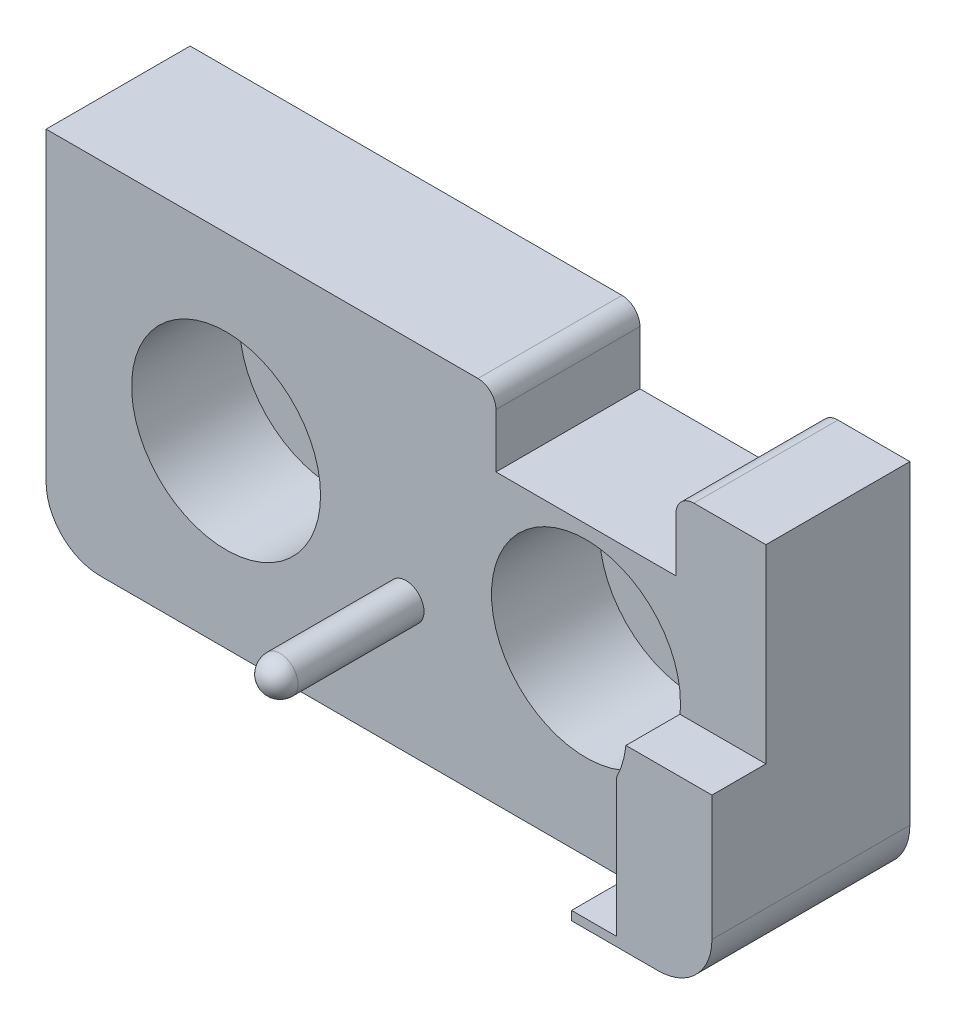
ISO-10303-21;
HEADER;
FILE_DESCRIPTION(('STEP AP214'),'2;1');
FILE_NAME('part.step','',(''),(''),'','','');
FILE_SCHEMA(('AUTOMOTIVE_DESIGN { 1 0 10303 214 1 1 1 1 }'));
ENDSEC;
DATA;
#1=APPLICATION_CONTEXT('core data for automotive mechanical design processes');
#2=APPLICATION_PROTOCOL_DEFINITION('international standard','automotive_design',2000,#1);
#3=PRODUCT_CONTEXT('',#1,'mechanical');
#4=PRODUCT('Part','Part','',(#3));
#5=PRODUCT_RELATED_PRODUCT_CATEGORY('part','',(#4));
#6=PRODUCT_DEFINITION_FORMATION('','',#4);
#7=PRODUCT_DEFINITION_CONTEXT('part definition',#1,'design');
#8=PRODUCT_DEFINITION('design','',#6,#7);
#9=PRODUCT_DEFINITION_SHAPE('','',#8);
#10=(LENGTH_UNIT() NAMED_UNIT(*) SI_UNIT(.MILLI.,.METRE.));
#11=(NAMED_UNIT(*) PLANE_ANGLE_UNIT() SI_UNIT($,.RADIAN.));
#12=(NAMED_UNIT(*) SI_UNIT($,.STERADIAN.) SOLID_ANGLE_UNIT());
#13=UNCERTAINTY_MEASURE_WITH_UNIT(LENGTH_MEASURE(1.E-05),#10,'distance_accuracy_value','');
#14=(GEOMETRIC_REPRESENTATION_CONTEXT(3) GLOBAL_UNCERTAINTY_ASSIGNED_CONTEXT((#13)) GLOBAL_UNIT_ASSIGNED_CONTEXT((#10,
#11,#12)) REPRESENTATION_CONTEXT('',''));
#15=CARTESIAN_POINT('',(0.,0.,0.));
#16=DIRECTION('',(0.,0.,1.));
#17=DIRECTION('',(1.,0.,0.));
#18=AXIS2_PLACEMENT_3D('',#15,#16,#17);
#19=CARTESIAN_POINT('',(17.,-7.,8.));
#20=DIRECTION('',(0.,0.,1.));
#21=DIRECTION('',(1.,0.,0.));
#22=AXIS2_PLACEMENT_3D('',#19,#20,#21);
#23=PLANE('',#22);
#24=DIRECTION('',(0.,-1.,0.));
#25=VECTOR('',#24,1.);
#26=CARTESIAN_POINT('',(14.7,-7.,8.));
#27=LINE('',#26,#25);
#28=CARTESIAN_POINT('',(14.7,-2.33933751305791,8.));
#29=VERTEX_POINT('',#28);
#30=CARTESIAN_POINT('',(14.7,-10.,8.));
#31=VERTEX_POINT('',#30);
#32=EDGE_CURVE('E227',#29,#31,#27,.T.);
#33=ORIENTED_EDGE('',*,*,#32,.F.);
#34=CARTESIAN_POINT('',(10.,0.,8.));
#35=DIRECTION('',(0.,0.,1.));
#36=DIRECTION('',(1.,0.,0.));
#37=AXIS2_PLACEMENT_3D('',#34,#35,#36);
#38=CIRCLE('',#37,5.25);
#39=CARTESIAN_POINT('',(15.2211109928826,-0.550000000000002,8.));
#40=VERTEX_POINT('',#39);
#41=EDGE_CURVE('E245',#40,#29,#38,.T.);
#42=ORIENTED_EDGE('',*,*,#41,.F.);
#43=DIRECTION('',(-1.,0.,0.));
#44=VECTOR('',#43,1.);
#45=CARTESIAN_POINT('',(17.,-0.550000000000002,8.));
#46=LINE('',#45,#44);
#47=CARTESIAN_POINT('',(20.,-0.550000000000001,8.));
#48=VERTEX_POINT('',#47);
#49=EDGE_CURVE('E213',#48,#40,#46,.T.);
#50=ORIENTED_EDGE('',*,*,#49,.F.);
#51=DIRECTION('',(0.,1.,0.));
#52=VECTOR('',#51,1.);
#53=CARTESIAN_POINT('',(20.,-6.99999999999998,8.));
#54=LINE('',#53,#52);
#55=CARTESIAN_POINT('',(20.,10.,8.));
#56=VERTEX_POINT('',#55);
#57=EDGE_CURVE('E171',#48,#56,#54,.T.);
#58=ORIENTED_EDGE('',*,*,#57,.T.);
#59=DIRECTION('',(-1.,0.,0.));
#60=VECTOR('',#59,1.);
#61=CARTESIAN_POINT('',(16.,10.,8.));
#62=LINE('',#61,#60);
#63=CARTESIAN_POINT('',(16.,10.,8.));
#64=VERTEX_POINT('',#63);
#65=EDGE_CURVE('E258',#56,#64,#62,.T.);
#66=ORIENTED_EDGE('',*,*,#65,.T.);
#67=CARTESIAN_POINT('',(16.,9.,8.));
#68=DIRECTION('',(0.,0.,1.));
#69=DIRECTION('',(1.,0.,0.));
#70=AXIS2_PLACEMENT_3D('',#67,#68,#69);
#71=CIRCLE('',#70,1.);
#72=CARTESIAN_POINT('',(15.,8.99999999999999,8.));
#73=VERTEX_POINT('',#72);
#74=EDGE_CURVE('E261',#64,#73,#71,.T.);
#75=ORIENTED_EDGE('',*,*,#74,.T.);
#76=DIRECTION('',(0.,-1.,0.));
#77=VECTOR('',#76,1.);
#78=CARTESIAN_POINT('',(15.,8.99999999999999,8.));
#79=LINE('',#78,#77);
#80=CARTESIAN_POINT('',(15.,6.,8.));
#81=VERTEX_POINT('',#80);
#82=EDGE_CURVE('E264',#73,#81,#79,.T.);
#83=ORIENTED_EDGE('',*,*,#82,.T.);
#84=DIRECTION('',(-1.,0.,0.));
#85=VECTOR('',#84,1.);
#86=CARTESIAN_POINT('',(5.,6.,8.));
#87=LINE('',#86,#85);
#88=CARTESIAN_POINT('',(5.,6.,8.));
#89=VERTEX_POINT('',#88);
#90=EDGE_CURVE('E266',#81,#89,#87,.T.);
#91=ORIENTED_EDGE('',*,*,#90,.T.);
#92=DIRECTION('',(0.,1.,0.));
#93=VECTOR('',#92,1.);
#94=CARTESIAN_POINT('',(5.,8.99999999999999,8.));
#95=LINE('',#94,#93);
#96=CARTESIAN_POINT('',(5.,8.99999999999999,8.));
#97=VERTEX_POINT('',#96);
#98=EDGE_CURVE('E268',#89,#97,#95,.T.);
#99=ORIENTED_EDGE('',*,*,#98,.T.);
#100=CARTESIAN_POINT('',(4.,9.,8.));
#101=DIRECTION('',(0.,0.,1.));
#102=DIRECTION('',(-1.,0.,0.));
#103=AXIS2_PLACEMENT_3D('',#100,#101,#102);
#104=CIRCLE('',#103,1.);
#105=CARTESIAN_POINT('',(3.99999999999999,10.,8.));
#106=VERTEX_POINT('',#105);
#107=EDGE_CURVE('E270',#97,#106,#104,.T.);
#108=ORIENTED_EDGE('',*,*,#107,.T.);
#109=DIRECTION('',(-1.,0.,0.));
#110=VECTOR('',#109,1.);
#111=CARTESIAN_POINT('',(-20.,10.,8.));
#112=LINE('',#111,#110);
#113=CARTESIAN_POINT('',(-20.,10.,8.));
#114=VERTEX_POINT('',#113);
#115=EDGE_CURVE('E272',#106,#114,#112,.T.);
#116=ORIENTED_EDGE('',*,*,#115,.T.);
#117=DIRECTION('',(0.,-1.,0.));
#118=VECTOR('',#117,1.);
#119=CARTESIAN_POINT('',(-20.,-6.99999999999998,8.));
#120=LINE('',#119,#118);
#121=CARTESIAN_POINT('',(-20.,-6.99999999999998,8.));
#122=VERTEX_POINT('',#121);
#123=EDGE_CURVE('E274',#114,#122,#120,.T.);
#124=ORIENTED_EDGE('',*,*,#123,.T.);
#125=CARTESIAN_POINT('',(-17.,-7.,8.));
#126=DIRECTION('',(0.,0.,1.));
#127=DIRECTION('',(-1.,0.,0.));
#128=AXIS2_PLACEMENT_3D('',#125,#126,#127);
#129=CIRCLE('',#128,3.);
#130=CARTESIAN_POINT('',(-17.,-10.,8.));
#131=VERTEX_POINT('',#130);
#132=EDGE_CURVE('E276',#122,#131,#129,.T.);
#133=ORIENTED_EDGE('',*,*,#132,.T.);
#134=DIRECTION('',(1.,0.,0.));
#135=VECTOR('',#134,1.);
#136=CARTESIAN_POINT('',(-17.,-10.,8.));
#137=LINE('',#136,#135);
#138=CARTESIAN_POINT('',(12.2,-10.,8.));
#139=VERTEX_POINT('',#138);
#140=EDGE_CURVE('E278',#131,#139,#137,.T.);
#141=ORIENTED_EDGE('',*,*,#140,.T.);
#142=DIRECTION('',(-1.,0.,0.));
#143=VECTOR('',#142,1.);
#144=CARTESIAN_POINT('',(17.,-10.,8.));
#145=LINE('',#144,#143);
#146=EDGE_CURVE('E49',#31,#139,#145,.T.);
#147=ORIENTED_EDGE('',*,*,#146,.F.);
#148=EDGE_LOOP('',(#33,#42,#50,#58,#66,#75,#83,#91,#99,#108,#116,#124,#133,#141,#147));
#149=FACE_BOUND('',#148,.T.);
#150=CARTESIAN_POINT('',(-10.,0.,8.));
#151=DIRECTION('',(0.,0.,1.));
#152=DIRECTION('',(1.,0.,0.));
#153=AXIS2_PLACEMENT_3D('',#150,#151,#152);
#154=CIRCLE('',#153,5.25);
#155=CARTESIAN_POINT('',(-4.75,0.,8.));
#156=VERTEX_POINT('',#155);
#157=EDGE_CURVE('E233',#156,#156,#154,.T.);
#158=ORIENTED_EDGE('',*,*,#157,.F.);
#159=EDGE_LOOP('',(#158));
#160=FACE_BOUND('',#159,.T.);
#161=CARTESIAN_POINT('',(0.,-2.72729824717982,8.));
#162=DIRECTION('',(0.,0.,1.));
#163=DIRECTION('',(1.,0.,0.));
#164=AXIS2_PLACEMENT_3D('',#161,#162,#163);
#165=CIRCLE('',#164,1.);
#166=CARTESIAN_POINT('',(1.,-2.72729824717982,8.));
#167=VERTEX_POINT('',#166);
#168=EDGE_CURVE('E230',#167,#167,#165,.T.);
#169=ORIENTED_EDGE('',*,*,#168,.F.);
#170=EDGE_LOOP('',(#169));
#171=FACE_BOUND('',#170,.T.);
#172=ADVANCED_FACE('F34',(#149,#160,#171),#23,.T.);
#173=CARTESIAN_POINT('',(16.,10.,8.));
#174=DIRECTION('',(0.,-1.,0.));
#175=DIRECTION('',(1.,0.,0.));
#176=AXIS2_PLACEMENT_3D('',#173,#174,#175);
#177=PLANE('',#176);
#178=DIRECTION('',(-1.,0.,0.));
#179=VECTOR('',#178,1.);
#180=CARTESIAN_POINT('',(16.,10.,0.));
#181=LINE('',#180,#179);
#182=CARTESIAN_POINT('',(20.,10.,0.));
#183=VERTEX_POINT('',#182);
#184=CARTESIAN_POINT('',(16.,10.,0.));
#185=VERTEX_POINT('',#184);
#186=EDGE_CURVE('E257',#183,#185,#181,.T.);
#187=ORIENTED_EDGE('',*,*,#186,.T.);
#188=DIRECTION('',(0.,0.,-1.));
#189=VECTOR('',#188,1.);
#190=CARTESIAN_POINT('',(16.,10.,8.));
#191=LINE('',#190,#189);
#192=EDGE_CURVE('E42',#64,#185,#191,.T.);
#193=ORIENTED_EDGE('',*,*,#192,.F.);
#194=ORIENTED_EDGE('',*,*,#65,.F.);
#195=DIRECTION('',(0.,0.,-1.));
#196=VECTOR('',#195,1.);
#197=CARTESIAN_POINT('',(20.,10.,8.));
#198=LINE('',#197,#196);
#199=EDGE_CURVE('E281',#56,#183,#198,.T.);
#200=ORIENTED_EDGE('',*,*,#199,.T.);
#201=EDGE_LOOP('',(#187,#193,#194,#200));
#202=FACE_BOUND('',#201,.T.);
#203=ADVANCED_FACE('F336',(#202),#177,.F.);
#204=CARTESIAN_POINT('',(16.,9.,8.));
#205=DIRECTION('',(0.,0.,-1.));
#206=DIRECTION('',(-1.,0.,0.));
#207=AXIS2_PLACEMENT_3D('',#204,#205,#206);
#208=CYLINDRICAL_SURFACE('',#207,1.);
#209=CARTESIAN_POINT('',(16.,9.,0.));
#210=DIRECTION('',(0.,0.,1.));
#211=DIRECTION('',(1.,0.,0.));
#212=AXIS2_PLACEMENT_3D('',#209,#210,#211);
#213=CIRCLE('',#212,1.);
#214=CARTESIAN_POINT('',(15.,8.99999999999999,0.));
#215=VERTEX_POINT('',#214);
#216=EDGE_CURVE('E284',#185,#215,#213,.T.);
#217=ORIENTED_EDGE('',*,*,#216,.T.);
#218=DIRECTION('',(0.,0.,-1.));
#219=VECTOR('',#218,1.);
#220=CARTESIAN_POINT('',(15.,8.99999999999999,8.));
#221=LINE('',#220,#219);
#222=EDGE_CURVE('E326',#73,#215,#221,.T.);
#223=ORIENTED_EDGE('',*,*,#222,.F.);
#224=ORIENTED_EDGE('',*,*,#74,.F.);
#225=ORIENTED_EDGE('',*,*,#192,.T.);
#226=EDGE_LOOP('',(#217,#223,#224,#225));
#227=FACE_BOUND('',#226,.T.);
#228=ADVANCED_FACE('F331',(#227),#208,.T.);
#229=CARTESIAN_POINT('',(15.,8.99999999999999,8.));
#230=DIRECTION('',(1.,0.,0.));
#231=DIRECTION('',(0.,1.,0.));
#232=AXIS2_PLACEMENT_3D('',#229,#230,#231);
#233=PLANE('',#232);
#234=DIRECTION('',(0.,-1.,0.));
#235=VECTOR('',#234,1.);
#236=CARTESIAN_POINT('',(15.,8.99999999999999,0.));
#237=LINE('',#236,#235);
#238=CARTESIAN_POINT('',(15.,6.,0.));
#239=VERTEX_POINT('',#238);
#240=EDGE_CURVE('E286',#215,#239,#237,.T.);
#241=ORIENTED_EDGE('',*,*,#240,.T.);
#242=DIRECTION('',(0.,0.,-1.));
#243=VECTOR('',#242,1.);
#244=CARTESIAN_POINT('',(15.,6.,8.));
#245=LINE('',#244,#243);
#246=EDGE_CURVE('E323',#81,#239,#245,.T.);
#247=ORIENTED_EDGE('',*,*,#246,.F.);
#248=ORIENTED_EDGE('',*,*,#82,.F.);
#249=ORIENTED_EDGE('',*,*,#222,.T.);
#250=EDGE_LOOP('',(#241,#247,#248,#249));
#251=FACE_BOUND('',#250,.T.);
#252=ADVANCED_FACE('F346',(#251),#233,.F.);
#253=CARTESIAN_POINT('',(5.,6.,8.));
#254=DIRECTION('',(0.,-1.,0.));
#255=DIRECTION('',(1.,0.,0.));
#256=AXIS2_PLACEMENT_3D('',#253,#254,#255);
#257=PLANE('',#256);
#258=DIRECTION('',(-1.,0.,0.));
#259=VECTOR('',#258,1.);
#260=CARTESIAN_POINT('',(5.,6.,0.));
#261=LINE('',#260,#259);
#262=CARTESIAN_POINT('',(5.,6.,0.));
#263=VERTEX_POINT('',#262);
#264=EDGE_CURVE('E288',#239,#263,#261,.T.);
#265=ORIENTED_EDGE('',*,*,#264,.T.);
#266=DIRECTION('',(0.,0.,-1.));
#267=VECTOR('',#266,1.);
#268=CARTESIAN_POINT('',(5.,6.,8.));
#269=LINE('',#268,#267);
#270=EDGE_CURVE('E320',#89,#263,#269,.T.);
#271=ORIENTED_EDGE('',*,*,#270,.F.);
#272=ORIENTED_EDGE('',*,*,#90,.F.);
#273=ORIENTED_EDGE('',*,*,#246,.T.);
#274=EDGE_LOOP('',(#265,#271,#272,#273));
#275=FACE_BOUND('',#274,.T.);
#276=ADVANCED_FACE('F350',(#275),#257,.F.);
#277=CARTESIAN_POINT('',(5.,8.99999999999999,8.));
#278=DIRECTION('',(-1.,0.,0.));
#279=DIRECTION('',(0.,-1.,0.));
#280=AXIS2_PLACEMENT_3D('',#277,#278,#279);
#281=PLANE('',#280);
#282=DIRECTION('',(0.,1.,0.));
#283=VECTOR('',#282,1.);
#284=CARTESIAN_POINT('',(5.,8.99999999999999,0.));
#285=LINE('',#284,#283);
#286=CARTESIAN_POINT('',(5.,8.99999999999999,0.));
#287=VERTEX_POINT('',#286);
#288=EDGE_CURVE('E290',#263,#287,#285,.T.);
#289=ORIENTED_EDGE('',*,*,#288,.T.);
#290=DIRECTION('',(0.,0.,-1.));
#291=VECTOR('',#290,1.);
#292=CARTESIAN_POINT('',(5.,8.99999999999999,8.));
#293=LINE('',#292,#291);
#294=EDGE_CURVE('E317',#97,#287,#293,.T.);
#295=ORIENTED_EDGE('',*,*,#294,.F.);
#296=ORIENTED_EDGE('',*,*,#98,.F.);
#297=ORIENTED_EDGE('',*,*,#270,.T.);
#298=EDGE_LOOP('',(#289,#295,#296,#297));
#299=FACE_BOUND('',#298,.T.);
#300=ADVANCED_FACE('F423',(#299),#281,.F.);
#301=CARTESIAN_POINT('',(4.,9.,8.));
#302=DIRECTION('',(0.,0.,-1.));
#303=DIRECTION('',(-1.,0.,0.));
#304=AXIS2_PLACEMENT_3D('',#301,#302,#303);
#305=CYLINDRICAL_SURFACE('',#304,1.);
#306=CARTESIAN_POINT('',(4.,9.,0.));
#307=DIRECTION('',(0.,0.,1.));
#308=DIRECTION('',(-1.,0.,0.));
#309=AXIS2_PLACEMENT_3D('',#306,#307,#308);
#310=CIRCLE('',#309,1.);
#311=CARTESIAN_POINT('',(3.99999999999999,10.,0.));
#312=VERTEX_POINT('',#311);
#313=EDGE_CURVE('E292',#287,#312,#310,.T.);
#314=ORIENTED_EDGE('',*,*,#313,.T.);
#315=DIRECTION('',(0.,0.,-1.));
#316=VECTOR('',#315,1.);
#317=CARTESIAN_POINT('',(3.99999999999999,10.,8.));
#318=LINE('',#317,#316);
#319=EDGE_CURVE('E314',#106,#312,#318,.T.);
#320=ORIENTED_EDGE('',*,*,#319,.F.);
#321=ORIENTED_EDGE('',*,*,#107,.F.);
#322=ORIENTED_EDGE('',*,*,#294,.T.);
#323=EDGE_LOOP('',(#314,#320,#321,#322));
#324=FACE_BOUND('',#323,.T.);
#325=ADVANCED_FACE('F419',(#324),#305,.T.);
#326=CARTESIAN_POINT('',(-20.,10.,8.));
#327=DIRECTION('',(0.,-1.,0.));
#328=DIRECTION('',(0.,0.,-1.));
#329=AXIS2_PLACEMENT_3D('',#326,#327,#328);
#330=PLANE('',#329);
#331=DIRECTION('',(-1.,0.,0.));
#332=VECTOR('',#331,1.);
#333=CARTESIAN_POINT('',(-20.,10.,0.));
#334=LINE('',#333,#332);
#335=CARTESIAN_POINT('',(-20.,10.,0.));
#336=VERTEX_POINT('',#335);
#337=EDGE_CURVE('E294',#312,#336,#334,.T.);
#338=ORIENTED_EDGE('',*,*,#337,.T.);
#339=DIRECTION('',(0.,0.,-1.));
#340=VECTOR('',#339,1.);
#341=CARTESIAN_POINT('',(-20.,10.,8.));
#342=LINE('',#341,#340);
#343=EDGE_CURVE('E311',#114,#336,#342,.T.);
#344=ORIENTED_EDGE('',*,*,#343,.F.);
#345=ORIENTED_EDGE('',*,*,#115,.F.);
#346=ORIENTED_EDGE('',*,*,#319,.T.);
#347=EDGE_LOOP('',(#338,#344,#345,#346));
#348=FACE_BOUND('',#347,.T.);
#349=ADVANCED_FACE('F415',(#348),#330,.F.);
#350=CARTESIAN_POINT('',(-20.,-6.99999999999998,8.));
#351=DIRECTION('',(1.,0.,0.));
#352=DIRECTION('',(0.,0.,-1.));
#353=AXIS2_PLACEMENT_3D('',#350,#351,#352);
#354=PLANE('',#353);
#355=DIRECTION('',(0.,-1.,0.));
#356=VECTOR('',#355,1.);
#357=CARTESIAN_POINT('',(-20.,-6.99999999999998,0.));
#358=LINE('',#357,#356);
#359=CARTESIAN_POINT('',(-20.,-6.99999999999998,0.));
#360=VERTEX_POINT('',#359);
#361=EDGE_CURVE('E296',#336,#360,#358,.T.);
#362=ORIENTED_EDGE('',*,*,#361,.T.);
#363=DIRECTION('',(0.,0.,-1.));
#364=VECTOR('',#363,1.);
#365=CARTESIAN_POINT('',(-20.,-6.99999999999998,8.));
#366=LINE('',#365,#364);
#367=EDGE_CURVE('E308',#122,#360,#366,.T.);
#368=ORIENTED_EDGE('',*,*,#367,.F.);
#369=ORIENTED_EDGE('',*,*,#123,.F.);
#370=ORIENTED_EDGE('',*,*,#343,.T.);
#371=EDGE_LOOP('',(#362,#368,#369,#370));
#372=FACE_BOUND('',#371,.T.);
#373=ADVANCED_FACE('F411',(#372),#354,.F.);
#374=CARTESIAN_POINT('',(-17.,-7.,8.));
#375=DIRECTION('',(0.,0.,-1.));
#376=DIRECTION('',(-1.,0.,0.));
#377=AXIS2_PLACEMENT_3D('',#374,#375,#376);
#378=CYLINDRICAL_SURFACE('',#377,3.);
#379=CARTESIAN_POINT('',(-17.,-7.,0.));
#380=DIRECTION('',(0.,0.,1.));
#381=DIRECTION('',(-1.,0.,0.));
#382=AXIS2_PLACEMENT_3D('',#379,#380,#381);
#383=CIRCLE('',#382,3.);
#384=CARTESIAN_POINT('',(-17.,-10.,0.));
#385=VERTEX_POINT('',#384);
#386=EDGE_CURVE('E298',#360,#385,#383,.T.);
#387=ORIENTED_EDGE('',*,*,#386,.T.);
#388=DIRECTION('',(0.,0.,-1.));
#389=VECTOR('',#388,1.);
#390=CARTESIAN_POINT('',(-17.,-10.,8.));
#391=LINE('',#390,#389);
#392=EDGE_CURVE('E305',#131,#385,#391,.T.);
#393=ORIENTED_EDGE('',*,*,#392,.F.);
#394=ORIENTED_EDGE('',*,*,#132,.F.);
#395=ORIENTED_EDGE('',*,*,#367,.T.);
#396=EDGE_LOOP('',(#387,#393,#394,#395));
#397=FACE_BOUND('',#396,.T.);
#398=ADVANCED_FACE('F408',(#397),#378,.T.);
#399=CARTESIAN_POINT('',(-17.,-10.,8.));
#400=DIRECTION('',(0.,1.,0.));
#401=DIRECTION('',(0.,0.,1.));
#402=AXIS2_PLACEMENT_3D('',#399,#400,#401);
#403=PLANE('',#402);
#404=DIRECTION('',(1.,0.,0.));
#405=VECTOR('',#404,1.);
#406=CARTESIAN_POINT('',(-17.,-10.,0.));
#407=LINE('',#406,#405);
#408=CARTESIAN_POINT('',(12.2,-10.,0.));
#409=VERTEX_POINT('',#408);
#410=EDGE_CURVE('E300',#385,#409,#407,.T.);
#411=ORIENTED_EDGE('',*,*,#410,.T.);
#412=DIRECTION('',(0.,0.,1.));
#413=VECTOR('',#412,1.);
#414=CARTESIAN_POINT('',(12.2,-10.,-12.6428833736612));
#415=LINE('',#414,#413);
#416=EDGE_CURVE('E57',#409,#139,#415,.T.);
#417=ORIENTED_EDGE('',*,*,#416,.T.);
#418=ORIENTED_EDGE('',*,*,#140,.F.);
#419=ORIENTED_EDGE('',*,*,#392,.T.);
#420=EDGE_LOOP('',(#411,#417,#418,#419));
#421=FACE_BOUND('',#420,.T.);
#422=ADVANCED_FACE('F405',(#421),#403,.F.);
#423=CARTESIAN_POINT('',(20.,-6.99999999999998,8.));
#424=DIRECTION('',(-1.,0.,0.));
#425=DIRECTION('',(0.,0.,1.));
#426=AXIS2_PLACEMENT_3D('',#423,#424,#425);
#427=PLANE('',#426);
#428=ORIENTED_EDGE('',*,*,#57,.F.);
#429=DIRECTION('',(0.,0.,1.));
#430=VECTOR('',#429,1.);
#431=CARTESIAN_POINT('',(20.,-0.550000000000001,-12.6428833736612));
#432=LINE('',#431,#430);
#433=CARTESIAN_POINT('',(20.,-0.550000000000001,11.));
#434=VERTEX_POINT('',#433);
#435=EDGE_CURVE('E164',#48,#434,#432,.T.);
#436=ORIENTED_EDGE('',*,*,#435,.T.);
#437=DIRECTION('',(0.,1.,0.));
#438=VECTOR('',#437,1.);
#439=CARTESIAN_POINT('',(20.,-0.550000000000001,11.));
#440=LINE('',#439,#438);
#441=CARTESIAN_POINT('',(20.,-7.49999999999998,11.));
#442=VERTEX_POINT('',#441);
#443=EDGE_CURVE('E169',#442,#434,#440,.T.);
#444=ORIENTED_EDGE('',*,*,#443,.F.);
#445=DIRECTION('',(0.,0.,1.));
#446=VECTOR('',#445,1.);
#447=CARTESIAN_POINT('',(20.,-7.49999999999998,-12.6428833736612));
#448=LINE('',#447,#446);
#449=CARTESIAN_POINT('',(20.,-7.5,0.));
#450=VERTEX_POINT('',#449);
#451=EDGE_CURVE('E209',#450,#442,#448,.T.);
#452=ORIENTED_EDGE('',*,*,#451,.F.);
#453=DIRECTION('',(0.,1.,0.));
#454=VECTOR('',#453,1.);
#455=CARTESIAN_POINT('',(20.,-6.99999999999998,0.));
#456=LINE('',#455,#454);
#457=EDGE_CURVE('E262',#450,#183,#456,.T.);
#458=ORIENTED_EDGE('',*,*,#457,.T.);
#459=ORIENTED_EDGE('',*,*,#199,.F.);
#460=EDGE_LOOP('',(#428,#436,#444,#452,#458,#459));
#461=FACE_BOUND('',#460,.T.);
#462=ADVANCED_FACE('F166',(#461),#427,.F.);
#463=CARTESIAN_POINT('',(17.,-7.,0.));
#464=DIRECTION('',(0.,0.,1.));
#465=DIRECTION('',(1.,0.,0.));
#466=AXIS2_PLACEMENT_3D('',#463,#464,#465);
#467=PLANE('',#466);
#468=ORIENTED_EDGE('',*,*,#457,.F.);
#469=CARTESIAN_POINT('',(17.,-7.5,0.));
#470=DIRECTION('',(0.,0.,1.));
#471=DIRECTION('',(1.,0.,0.));
#472=AXIS2_PLACEMENT_3D('',#469,#470,#471);
#473=CIRCLE('',#472,3.);
#474=CARTESIAN_POINT('',(17.,-10.5,0.));
#475=VERTEX_POINT('',#474);
#476=EDGE_CURVE('E211',#450,#475,#473,.F.);
#477=ORIENTED_EDGE('',*,*,#476,.T.);
#478=DIRECTION('',(-1.,0.,0.));
#479=VECTOR('',#478,1.);
#480=CARTESIAN_POINT('',(12.2,-10.5,0.));
#481=LINE('',#480,#479);
#482=CARTESIAN_POINT('',(12.2,-10.5,0.));
#483=VERTEX_POINT('',#482);
#484=EDGE_CURVE('E208',#475,#483,#481,.T.);
#485=ORIENTED_EDGE('',*,*,#484,.T.);
#486=DIRECTION('',(0.,1.,0.));
#487=VECTOR('',#486,1.);
#488=CARTESIAN_POINT('',(12.2,-10.,0.));
#489=LINE('',#488,#487);
#490=EDGE_CURVE('E205',#483,#409,#489,.T.);
#491=ORIENTED_EDGE('',*,*,#490,.T.);
#492=ORIENTED_EDGE('',*,*,#410,.F.);
#493=ORIENTED_EDGE('',*,*,#386,.F.);
#494=ORIENTED_EDGE('',*,*,#361,.F.);
#495=ORIENTED_EDGE('',*,*,#337,.F.);
#496=ORIENTED_EDGE('',*,*,#313,.F.);
#497=ORIENTED_EDGE('',*,*,#288,.F.);
#498=ORIENTED_EDGE('',*,*,#264,.F.);
#499=ORIENTED_EDGE('',*,*,#240,.F.);
#500=ORIENTED_EDGE('',*,*,#216,.F.);
#501=ORIENTED_EDGE('',*,*,#186,.F.);
#502=EDGE_LOOP('',(#468,#477,#485,#491,#492,#493,#494,#495,#496,#497,#498,#499,#500,#501));
#503=FACE_BOUND('',#502,.T.);
#504=CARTESIAN_POINT('',(-10.,0.,0.));
#505=DIRECTION('',(0.,0.,1.));
#506=DIRECTION('',(1.,0.,0.));
#507=AXIS2_PLACEMENT_3D('',#504,#505,#506);
#508=CIRCLE('',#507,2.75);
#509=CARTESIAN_POINT('',(-7.25,0.,0.));
#510=VERTEX_POINT('',#509);
#511=EDGE_CURVE('E242',#510,#510,#508,.T.);
#512=ORIENTED_EDGE('',*,*,#511,.T.);
#513=EDGE_LOOP('',(#512));
#514=FACE_BOUND('',#513,.T.);
#515=CARTESIAN_POINT('',(10.,0.,0.));
#516=DIRECTION('',(0.,0.,1.));
#517=DIRECTION('',(1.,0.,0.));
#518=AXIS2_PLACEMENT_3D('',#515,#516,#517);
#519=CIRCLE('',#518,2.75);
#520=CARTESIAN_POINT('',(12.75,0.,0.));
#521=VERTEX_POINT('',#520);
#522=EDGE_CURVE('E254',#521,#521,#519,.T.);
#523=ORIENTED_EDGE('',*,*,#522,.T.);
#524=EDGE_LOOP('',(#523));
#525=FACE_BOUND('',#524,.T.);
#526=ADVANCED_FACE('F338',(#503,#514,#525),#467,.F.);
#527=CARTESIAN_POINT('',(10.,0.,8.));
#528=DIRECTION('',(0.,0.,1.));
#529=DIRECTION('',(1.,0.,0.));
#530=AXIS2_PLACEMENT_3D('',#527,#528,#529);
#531=CYLINDRICAL_SURFACE('',#530,2.75);
#532=ORIENTED_EDGE('',*,*,#522,.F.);
#533=EDGE_LOOP('',(#532));
#534=FACE_BOUND('',#533,.T.);
#535=CARTESIAN_POINT('',(10.,0.,2.));
#536=DIRECTION('',(0.,0.,1.));
#537=DIRECTION('',(1.,0.,0.));
#538=AXIS2_PLACEMENT_3D('',#535,#536,#537);
#539=CIRCLE('',#538,2.75);
#540=CARTESIAN_POINT('',(12.75,0.,2.));
#541=VERTEX_POINT('',#540);
#542=EDGE_CURVE('E251',#541,#541,#539,.T.);
#543=ORIENTED_EDGE('',*,*,#542,.T.);
#544=EDGE_LOOP('',(#543));
#545=FACE_BOUND('',#544,.T.);
#546=ADVANCED_FACE('F390',(#534,#545),#531,.F.);
#547=CARTESIAN_POINT('',(12.75,0.,2.));
#548=DIRECTION('',(0.,0.,-1.));
#549=DIRECTION('',(-1.,0.,0.));
#550=AXIS2_PLACEMENT_3D('',#547,#548,#549);
#551=PLANE('',#550);
#552=ORIENTED_EDGE('',*,*,#542,.F.);
#553=EDGE_LOOP('',(#552));
#554=FACE_BOUND('',#553,.T.);
#555=CARTESIAN_POINT('',(10.,0.,2.));
#556=DIRECTION('',(0.,0.,1.));
#557=DIRECTION('',(1.,0.,0.));
#558=AXIS2_PLACEMENT_3D('',#555,#556,#557);
#559=CIRCLE('',#558,5.25);
#560=CARTESIAN_POINT('',(15.25,0.,2.));
#561=VERTEX_POINT('',#560);
#562=EDGE_CURVE('E248',#561,#561,#559,.T.);
#563=ORIENTED_EDGE('',*,*,#562,.T.);
#564=EDGE_LOOP('',(#563));
#565=FACE_BOUND('',#564,.T.);
#566=ADVANCED_FACE('F380',(#554,#565),#551,.F.);
#567=CARTESIAN_POINT('',(10.,0.,8.));
#568=DIRECTION('',(0.,0.,1.));
#569=DIRECTION('',(1.,0.,0.));
#570=AXIS2_PLACEMENT_3D('',#567,#568,#569);
#571=CYLINDRICAL_SURFACE('',#570,5.25);
#572=ORIENTED_EDGE('',*,*,#562,.F.);
#573=EDGE_LOOP('',(#572));
#574=FACE_BOUND('',#573,.T.);
#575=ORIENTED_EDGE('',*,*,#41,.T.);
#576=DIRECTION('',(0.,0.,1.));
#577=VECTOR('',#576,1.);
#578=CARTESIAN_POINT('',(14.7,-2.3393375130579,-12.6428833736612));
#579=LINE('',#578,#577);
#580=CARTESIAN_POINT('',(14.7,-2.3393375130579,11.));
#581=VERTEX_POINT('',#580);
#582=EDGE_CURVE('E223',#29,#581,#579,.T.);
#583=ORIENTED_EDGE('',*,*,#582,.T.);
#584=CARTESIAN_POINT('',(10.,0.,11.));
#585=DIRECTION('',(0.,0.,-1.));
#586=DIRECTION('',(1.,0.,0.));
#587=AXIS2_PLACEMENT_3D('',#584,#585,#586);
#588=CIRCLE('',#587,5.25);
#589=CARTESIAN_POINT('',(15.2211109928826,-0.550000000000002,11.));
#590=VERTEX_POINT('',#589);
#591=EDGE_CURVE('E184',#590,#581,#588,.T.);
#592=ORIENTED_EDGE('',*,*,#591,.F.);
#593=DIRECTION('',(0.,0.,1.));
#594=VECTOR('',#593,1.);
#595=CARTESIAN_POINT('',(15.2211109928826,-0.550000000000002,-12.6428833736612));
#596=LINE('',#595,#594);
#597=EDGE_CURVE('E174',#40,#590,#596,.T.);
#598=ORIENTED_EDGE('',*,*,#597,.F.);
#599=EDGE_LOOP('',(#575,#583,#592,#598));
#600=FACE_BOUND('',#599,.T.);
#601=ADVANCED_FACE('F377',(#574,#600),#571,.F.);
#602=CARTESIAN_POINT('',(-10.,0.,8.));
#603=DIRECTION('',(0.,0.,1.));
#604=DIRECTION('',(1.,0.,0.));
#605=AXIS2_PLACEMENT_3D('',#602,#603,#604);
#606=CYLINDRICAL_SURFACE('',#605,2.75);
#607=ORIENTED_EDGE('',*,*,#511,.F.);
#608=EDGE_LOOP('',(#607));
#609=FACE_BOUND('',#608,.T.);
#610=CARTESIAN_POINT('',(-10.,0.,2.));
#611=DIRECTION('',(0.,0.,1.));
#612=DIRECTION('',(1.,0.,0.));
#613=AXIS2_PLACEMENT_3D('',#610,#611,#612);
#614=CIRCLE('',#613,2.75);
#615=CARTESIAN_POINT('',(-7.25,0.,2.));
#616=VERTEX_POINT('',#615);
#617=EDGE_CURVE('E239',#616,#616,#614,.T.);
#618=ORIENTED_EDGE('',*,*,#617,.T.);
#619=EDGE_LOOP('',(#618));
#620=FACE_BOUND('',#619,.T.);
#621=ADVANCED_FACE('F379',(#609,#620),#606,.F.);
#622=CARTESIAN_POINT('',(-7.25,0.,2.));
#623=DIRECTION('',(0.,0.,-1.));
#624=DIRECTION('',(-1.,0.,0.));
#625=AXIS2_PLACEMENT_3D('',#622,#623,#624);
#626=PLANE('',#625);
#627=ORIENTED_EDGE('',*,*,#617,.F.);
#628=EDGE_LOOP('',(#627));
#629=FACE_BOUND('',#628,.T.);
#630=CARTESIAN_POINT('',(-10.,0.,2.));
#631=DIRECTION('',(0.,0.,1.));
#632=DIRECTION('',(1.,0.,0.));
#633=AXIS2_PLACEMENT_3D('',#630,#631,#632);
#634=CIRCLE('',#633,5.25);
#635=CARTESIAN_POINT('',(-4.75,0.,2.));
#636=VERTEX_POINT('',#635);
#637=EDGE_CURVE('E236',#636,#636,#634,.T.);
#638=ORIENTED_EDGE('',*,*,#637,.T.);
#639=EDGE_LOOP('',(#638));
#640=FACE_BOUND('',#639,.T.);
#641=ADVANCED_FACE('F387',(#629,#640),#626,.F.);
#642=CARTESIAN_POINT('',(-10.,0.,8.));
#643=DIRECTION('',(0.,0.,1.));
#644=DIRECTION('',(1.,0.,0.));
#645=AXIS2_PLACEMENT_3D('',#642,#643,#644);
#646=CYLINDRICAL_SURFACE('',#645,5.25);
#647=ORIENTED_EDGE('',*,*,#637,.F.);
#648=EDGE_LOOP('',(#647));
#649=FACE_BOUND('',#648,.T.);
#650=ORIENTED_EDGE('',*,*,#157,.T.);
#651=EDGE_LOOP('',(#650));
#652=FACE_BOUND('',#651,.T.);
#653=ADVANCED_FACE('F558',(#649,#652),#646,.F.);
#654=CARTESIAN_POINT('',(0.,-2.72729824717982,16.));
#655=DIRECTION('',(0.,0.,-1.));
#656=DIRECTION('',(-1.,0.,0.));
#657=AXIS2_PLACEMENT_3D('',#654,#655,#656);
#658=CYLINDRICAL_SURFACE('',#657,1.);
#659=CARTESIAN_POINT('',(0.,-2.72729824717982,15.));
#660=DIRECTION('',(0.,0.,-1.));
#661=DIRECTION('',(-1.,0.,0.));
#662=AXIS2_PLACEMENT_3D('',#659,#660,#661);
#663=CIRCLE('',#662,1.);
#664=CARTESIAN_POINT('',(-1.,-2.72729824717982,15.));
#665=VERTEX_POINT('',#664);
#666=EDGE_CURVE('E11',#665,#665,#663,.T.);
#667=ORIENTED_EDGE('',*,*,#666,.T.);
#668=EDGE_LOOP('',(#667));
#669=FACE_BOUND('',#668,.T.);
#670=ORIENTED_EDGE('',*,*,#168,.T.);
#671=EDGE_LOOP('',(#670));
#672=FACE_BOUND('',#671,.T.);
#673=ADVANCED_FACE('F555',(#669,#672),#658,.T.);
#674=CARTESIAN_POINT('',(0.,-2.72729824717982,15.));
#675=DIRECTION('',(0.,0.,1.));
#676=DIRECTION('',(1.,0.,0.));
#677=AXIS2_PLACEMENT_3D('',#674,#675,#676);
#678=SPHERICAL_SURFACE('',#677,1.);
#679=ORIENTED_EDGE('',*,*,#666,.F.);
#680=EDGE_LOOP('',(#679));
#681=FACE_BOUND('',#680,.T.);
#682=ADVANCED_FACE('F36',(#681),#678,.T.);
#683=CARTESIAN_POINT('',(17.,-7.5,-12.6428833736612));
#684=DIRECTION('',(0.,0.,1.));
#685=DIRECTION('',(1.,0.,0.));
#686=AXIS2_PLACEMENT_3D('',#683,#684,#685);
#687=CYLINDRICAL_SURFACE('',#686,3.);
#688=ORIENTED_EDGE('',*,*,#476,.F.);
#689=ORIENTED_EDGE('',*,*,#451,.T.);
#690=CARTESIAN_POINT('',(17.,-7.5,11.));
#691=DIRECTION('',(0.,0.,1.));
#692=DIRECTION('',(-1.,0.,0.));
#693=AXIS2_PLACEMENT_3D('',#690,#691,#692);
#694=CIRCLE('',#693,3.);
#695=CARTESIAN_POINT('',(17.,-10.5,11.));
#696=VERTEX_POINT('',#695);
#697=EDGE_CURVE('E175',#696,#442,#694,.T.);
#698=ORIENTED_EDGE('',*,*,#697,.F.);
#699=DIRECTION('',(0.,0.,1.));
#700=VECTOR('',#699,1.);
#701=CARTESIAN_POINT('',(17.,-10.5,-12.6428833736612));
#702=LINE('',#701,#700);
#703=EDGE_CURVE('E215',#475,#696,#702,.T.);
#704=ORIENTED_EDGE('',*,*,#703,.F.);
#705=EDGE_LOOP('',(#688,#689,#698,#704));
#706=FACE_BOUND('',#705,.T.);
#707=ADVANCED_FACE('F356',(#706),#687,.T.);
#708=CARTESIAN_POINT('',(12.2,-10.5,-12.6428833736612));
#709=DIRECTION('',(0.,-1.,0.));
#710=DIRECTION('',(0.,0.,-1.));
#711=AXIS2_PLACEMENT_3D('',#708,#709,#710);
#712=PLANE('',#711);
#713=ORIENTED_EDGE('',*,*,#484,.F.);
#714=ORIENTED_EDGE('',*,*,#703,.T.);
#715=DIRECTION('',(1.,0.,0.));
#716=VECTOR('',#715,1.);
#717=CARTESIAN_POINT('',(12.2,-10.5,11.));
#718=LINE('',#717,#716);
#719=CARTESIAN_POINT('',(12.2,-10.5,11.));
#720=VERTEX_POINT('',#719);
#721=EDGE_CURVE('E202',#720,#696,#718,.T.);
#722=ORIENTED_EDGE('',*,*,#721,.F.);
#723=DIRECTION('',(0.,0.,1.));
#724=VECTOR('',#723,1.);
#725=CARTESIAN_POINT('',(12.2,-10.5,-12.6428833736612));
#726=LINE('',#725,#724);
#727=EDGE_CURVE('E217',#483,#720,#726,.T.);
#728=ORIENTED_EDGE('',*,*,#727,.F.);
#729=EDGE_LOOP('',(#713,#714,#722,#728));
#730=FACE_BOUND('',#729,.T.);
#731=ADVANCED_FACE('F362',(#730),#712,.T.);
#732=CARTESIAN_POINT('',(12.2,-10.,-12.6428833736612));
#733=DIRECTION('',(-1.,0.,0.));
#734=DIRECTION('',(0.,-1.,0.));
#735=AXIS2_PLACEMENT_3D('',#732,#733,#734);
#736=PLANE('',#735);
#737=ORIENTED_EDGE('',*,*,#490,.F.);
#738=ORIENTED_EDGE('',*,*,#727,.T.);
#739=DIRECTION('',(0.,-1.,0.));
#740=VECTOR('',#739,1.);
#741=CARTESIAN_POINT('',(12.2,-10.,11.));
#742=LINE('',#741,#740);
#743=CARTESIAN_POINT('',(12.2,-10.,11.));
#744=VERTEX_POINT('',#743);
#745=EDGE_CURVE('E199',#744,#720,#742,.T.);
#746=ORIENTED_EDGE('',*,*,#745,.F.);
#747=EDGE_CURVE('E220',#139,#744,#415,.T.);
#748=ORIENTED_EDGE('',*,*,#747,.F.);
#749=ORIENTED_EDGE('',*,*,#416,.F.);
#750=EDGE_LOOP('',(#737,#738,#746,#748,#749));
#751=FACE_BOUND('',#750,.T.);
#752=ADVANCED_FACE('F366',(#751),#736,.T.);
#753=CARTESIAN_POINT('',(14.7,-10.,-12.6428833736612));
#754=DIRECTION('',(0.,1.,0.));
#755=DIRECTION('',(0.,0.,1.));
#756=AXIS2_PLACEMENT_3D('',#753,#754,#755);
#757=PLANE('',#756);
#758=DIRECTION('',(0.,0.,1.));
#759=VECTOR('',#758,1.);
#760=CARTESIAN_POINT('',(14.7,-10.,-12.6428833736612));
#761=LINE('',#760,#759);
#762=CARTESIAN_POINT('',(14.7,-10.,11.));
#763=VERTEX_POINT('',#762);
#764=EDGE_CURVE('E221',#31,#763,#761,.T.);
#765=ORIENTED_EDGE('',*,*,#764,.F.);
#766=ORIENTED_EDGE('',*,*,#146,.T.);
#767=ORIENTED_EDGE('',*,*,#747,.T.);
#768=DIRECTION('',(-1.,0.,0.));
#769=VECTOR('',#768,1.);
#770=CARTESIAN_POINT('',(14.7,-10.,11.));
#771=LINE('',#770,#769);
#772=EDGE_CURVE('E196',#763,#744,#771,.T.);
#773=ORIENTED_EDGE('',*,*,#772,.F.);
#774=EDGE_LOOP('',(#765,#766,#767,#773));
#775=FACE_BOUND('',#774,.T.);
#776=ADVANCED_FACE('F372',(#775),#757,.T.);
#777=CARTESIAN_POINT('',(14.7,-2.3393375130579,-12.6428833736612));
#778=DIRECTION('',(-1.,0.,0.));
#779=DIRECTION('',(0.,-1.,0.));
#780=AXIS2_PLACEMENT_3D('',#777,#778,#779);
#781=PLANE('',#780);
#782=ORIENTED_EDGE('',*,*,#582,.F.);
#783=ORIENTED_EDGE('',*,*,#32,.T.);
#784=ORIENTED_EDGE('',*,*,#764,.T.);
#785=DIRECTION('',(0.,-1.,0.));
#786=VECTOR('',#785,1.);
#787=CARTESIAN_POINT('',(14.7,-2.3393375130579,11.));
#788=LINE('',#787,#786);
#789=EDGE_CURVE('E193',#581,#763,#788,.T.);
#790=ORIENTED_EDGE('',*,*,#789,.F.);
#791=EDGE_LOOP('',(#782,#783,#784,#790));
#792=FACE_BOUND('',#791,.T.);
#793=ADVANCED_FACE('F375',(#792),#781,.T.);
#794=CARTESIAN_POINT('',(20.,-0.550000000000001,-12.6428833736612));
#795=DIRECTION('',(0.,1.,0.));
#796=DIRECTION('',(-1.,0.,0.));
#797=AXIS2_PLACEMENT_3D('',#794,#795,#796);
#798=PLANE('',#797);
#799=ORIENTED_EDGE('',*,*,#435,.F.);
#800=ORIENTED_EDGE('',*,*,#49,.T.);
#801=ORIENTED_EDGE('',*,*,#597,.T.);
#802=DIRECTION('',(-1.,0.,0.));
#803=VECTOR('',#802,1.);
#804=CARTESIAN_POINT('',(20.,-0.550000000000001,11.));
#805=LINE('',#804,#803);
#806=EDGE_CURVE('E178',#434,#590,#805,.T.);
#807=ORIENTED_EDGE('',*,*,#806,.F.);
#808=EDGE_LOOP('',(#799,#800,#801,#807));
#809=FACE_BOUND('',#808,.T.);
#810=ADVANCED_FACE('F179',(#809),#798,.T.);
#811=CARTESIAN_POINT('',(17.,-7.5,11.));
#812=DIRECTION('',(0.,0.,-1.));
#813=DIRECTION('',(-1.,0.,0.));
#814=AXIS2_PLACEMENT_3D('',#811,#812,#813);
#815=PLANE('',#814);
#816=ORIENTED_EDGE('',*,*,#443,.T.);
#817=ORIENTED_EDGE('',*,*,#806,.T.);
#818=ORIENTED_EDGE('',*,*,#591,.T.);
#819=ORIENTED_EDGE('',*,*,#789,.T.);
#820=ORIENTED_EDGE('',*,*,#772,.T.);
#821=ORIENTED_EDGE('',*,*,#745,.T.);
#822=ORIENTED_EDGE('',*,*,#721,.T.);
#823=ORIENTED_EDGE('',*,*,#697,.T.);
#824=EDGE_LOOP('',(#816,#817,#818,#819,#820,#821,#822,#823));
#825=FACE_BOUND('',#824,.T.);
#826=ADVANCED_FACE('F187',(#825),#815,.F.);
#827=CLOSED_SHELL('',(#172,#203,#228,#252,#276,#300,#325,#349,#373,#398,#422,#462,#526,#546,
#566,#601,#621,#641,#653,#673,#682,#707,#731,#752,#776,#793,#810,#826));
#828=MANIFOLD_SOLID_BREP('B2',#827);
#829=ADVANCED_BREP_SHAPE_REPRESENTATION('',(#18,#828),#14);
#830=SHAPE_DEFINITION_REPRESENTATION(#9,#829);
ENDSEC;
END-ISO-10303-21;
